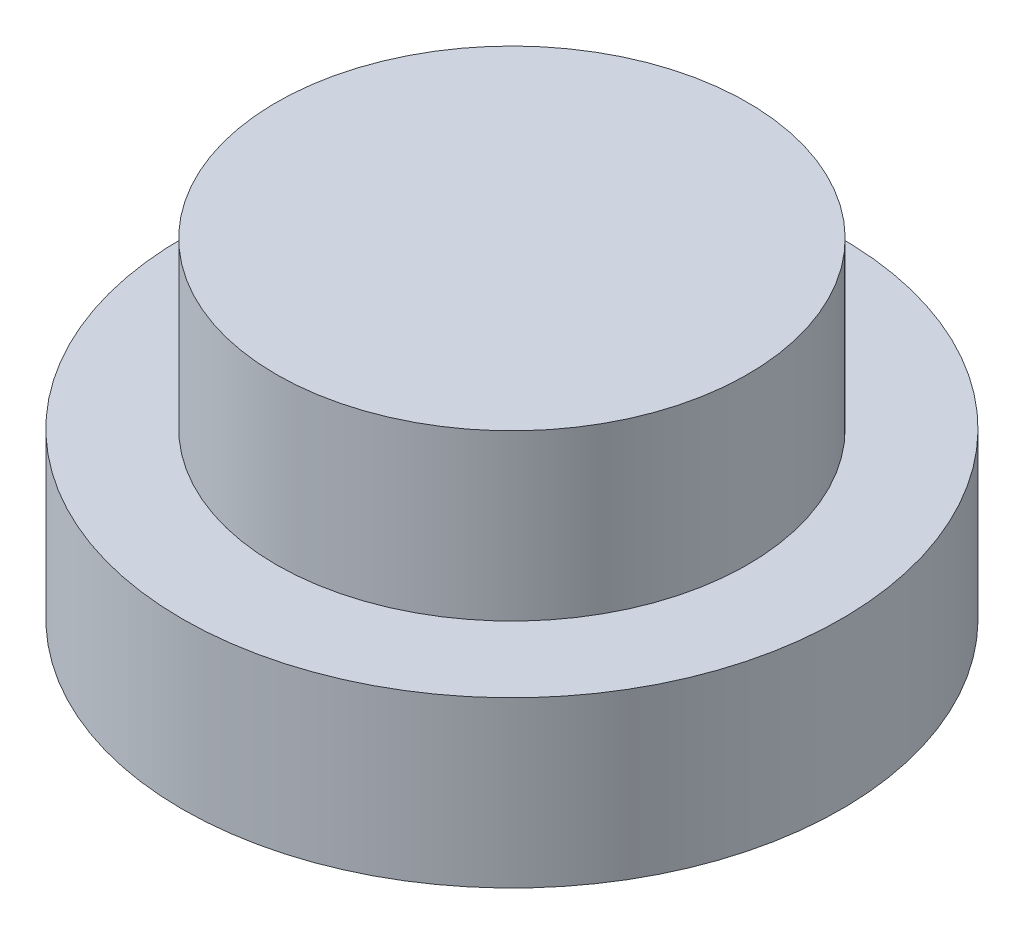
ISO-10303-21;
HEADER;
FILE_DESCRIPTION(('STEP AP214'),'2;1');
FILE_NAME('part.step','',(''),(''),'','','');
FILE_SCHEMA(('AUTOMOTIVE_DESIGN { 1 0 10303 214 1 1 1 1 }'));
ENDSEC;
DATA;
#1=APPLICATION_CONTEXT('core data for automotive mechanical design processes');
#2=APPLICATION_PROTOCOL_DEFINITION('international standard','automotive_design',2000,#1);
#3=PRODUCT_CONTEXT('',#1,'mechanical');
#4=PRODUCT('Part','Part','',(#3));
#5=PRODUCT_RELATED_PRODUCT_CATEGORY('part','',(#4));
#6=PRODUCT_DEFINITION_FORMATION('','',#4);
#7=PRODUCT_DEFINITION_CONTEXT('part definition',#1,'design');
#8=PRODUCT_DEFINITION('design','',#6,#7);
#9=PRODUCT_DEFINITION_SHAPE('','',#8);
#10=(LENGTH_UNIT() NAMED_UNIT(*) SI_UNIT(.MILLI.,.METRE.));
#11=(NAMED_UNIT(*) PLANE_ANGLE_UNIT() SI_UNIT($,.RADIAN.));
#12=(NAMED_UNIT(*) SI_UNIT($,.STERADIAN.) SOLID_ANGLE_UNIT());
#13=UNCERTAINTY_MEASURE_WITH_UNIT(LENGTH_MEASURE(1.E-05),#10,'distance_accuracy_value','');
#14=(GEOMETRIC_REPRESENTATION_CONTEXT(3) GLOBAL_UNCERTAINTY_ASSIGNED_CONTEXT((#13)) GLOBAL_UNIT_ASSIGNED_CONTEXT((#10,
#11,#12)) REPRESENTATION_CONTEXT('',''));
#15=CARTESIAN_POINT('',(0.,0.,0.));
#16=DIRECTION('',(0.,0.,1.));
#17=DIRECTION('',(1.,0.,0.));
#18=AXIS2_PLACEMENT_3D('',#15,#16,#17);
#19=CARTESIAN_POINT('',(0.,1.,0.));
#20=DIRECTION('',(0.,-1.,0.));
#21=DIRECTION('',(0.,0.,-1.));
#22=AXIS2_PLACEMENT_3D('',#19,#20,#21);
#23=CYLINDRICAL_SURFACE('',#22,2.);
#24=CARTESIAN_POINT('',(0.,1.,0.));
#25=DIRECTION('',(0.,1.,0.));
#26=DIRECTION('',(0.,0.,1.));
#27=AXIS2_PLACEMENT_3D('',#24,#25,#26);
#28=CIRCLE('',#27,2.);
#29=CARTESIAN_POINT('',(0.,1.,2.));
#30=VERTEX_POINT('',#29);
#31=EDGE_CURVE('E45',#30,#30,#28,.T.);
#32=ORIENTED_EDGE('',*,*,#31,.F.);
#33=EDGE_LOOP('',(#32));
#34=FACE_BOUND('',#33,.T.);
#35=CARTESIAN_POINT('',(0.,0.,0.));
#36=DIRECTION('',(0.,1.,0.));
#37=DIRECTION('',(0.,0.,1.));
#38=AXIS2_PLACEMENT_3D('',#35,#36,#37);
#39=CIRCLE('',#38,2.);
#40=CARTESIAN_POINT('',(0.,0.,2.));
#41=VERTEX_POINT('',#40);
#42=EDGE_CURVE('E40',#41,#41,#39,.T.);
#43=ORIENTED_EDGE('',*,*,#42,.T.);
#44=EDGE_LOOP('',(#43));
#45=FACE_BOUND('',#44,.T.);
#46=ADVANCED_FACE('F37',(#34,#45),#23,.T.);
#47=CARTESIAN_POINT('',(0.,1.,0.));
#48=DIRECTION('',(0.,1.,0.));
#49=DIRECTION('',(0.,0.,1.));
#50=AXIS2_PLACEMENT_3D('',#47,#48,#49);
#51=PLANE('',#50);
#52=CARTESIAN_POINT('',(0.,1.,0.));
#53=DIRECTION('',(0.,1.,0.));
#54=DIRECTION('',(0.,0.,1.));
#55=AXIS2_PLACEMENT_3D('',#52,#53,#54);
#56=CIRCLE('',#55,1.43);
#57=CARTESIAN_POINT('',(0.,1.,1.43));
#58=VERTEX_POINT('',#57);
#59=EDGE_CURVE('E10',#58,#58,#56,.T.);
#60=ORIENTED_EDGE('',*,*,#59,.F.);
#61=EDGE_LOOP('',(#60));
#62=FACE_BOUND('',#61,.T.);
#63=ORIENTED_EDGE('',*,*,#31,.T.);
#64=EDGE_LOOP('',(#63));
#65=FACE_BOUND('',#64,.T.);
#66=ADVANCED_FACE('F65',(#62,#65),#51,.T.);
#67=CARTESIAN_POINT('',(0.,0.,0.));
#68=DIRECTION('',(0.,1.,0.));
#69=DIRECTION('',(0.,0.,1.));
#70=AXIS2_PLACEMENT_3D('',#67,#68,#69);
#71=PLANE('',#70);
#72=ORIENTED_EDGE('',*,*,#42,.F.);
#73=EDGE_LOOP('',(#72));
#74=FACE_BOUND('',#73,.T.);
#75=ADVANCED_FACE('F62',(#74),#71,.F.);
#76=CARTESIAN_POINT('',(0.,2.,0.));
#77=DIRECTION('',(0.,-1.,0.));
#78=DIRECTION('',(0.,0.,-1.));
#79=AXIS2_PLACEMENT_3D('',#76,#77,#78);
#80=CYLINDRICAL_SURFACE('',#79,1.43);
#81=CARTESIAN_POINT('',(0.,2.,0.));
#82=DIRECTION('',(0.,1.,0.));
#83=DIRECTION('',(0.,0.,1.));
#84=AXIS2_PLACEMENT_3D('',#81,#82,#83);
#85=CIRCLE('',#84,1.43);
#86=CARTESIAN_POINT('',(0.,2.,1.43));
#87=VERTEX_POINT('',#86);
#88=EDGE_CURVE('E52',#87,#87,#85,.T.);
#89=ORIENTED_EDGE('',*,*,#88,.F.);
#90=EDGE_LOOP('',(#89));
#91=FACE_BOUND('',#90,.T.);
#92=ORIENTED_EDGE('',*,*,#59,.T.);
#93=EDGE_LOOP('',(#92));
#94=FACE_BOUND('',#93,.T.);
#95=ADVANCED_FACE('F64',(#91,#94),#80,.T.);
#96=CARTESIAN_POINT('',(0.,2.,0.));
#97=DIRECTION('',(0.,1.,0.));
#98=DIRECTION('',(0.,0.,1.));
#99=AXIS2_PLACEMENT_3D('',#96,#97,#98);
#100=PLANE('',#99);
#101=ORIENTED_EDGE('',*,*,#88,.T.);
#102=EDGE_LOOP('',(#101));
#103=FACE_BOUND('',#102,.T.);
#104=ADVANCED_FACE('F70',(#103),#100,.T.);
#105=CLOSED_SHELL('',(#46,#66,#75,#95,#104));
#106=MANIFOLD_SOLID_BREP('B2',#105);
#107=ADVANCED_BREP_SHAPE_REPRESENTATION('',(#18,#106),#14);
#108=SHAPE_DEFINITION_REPRESENTATION(#9,#107);
ENDSEC;
END-ISO-10303-21;
